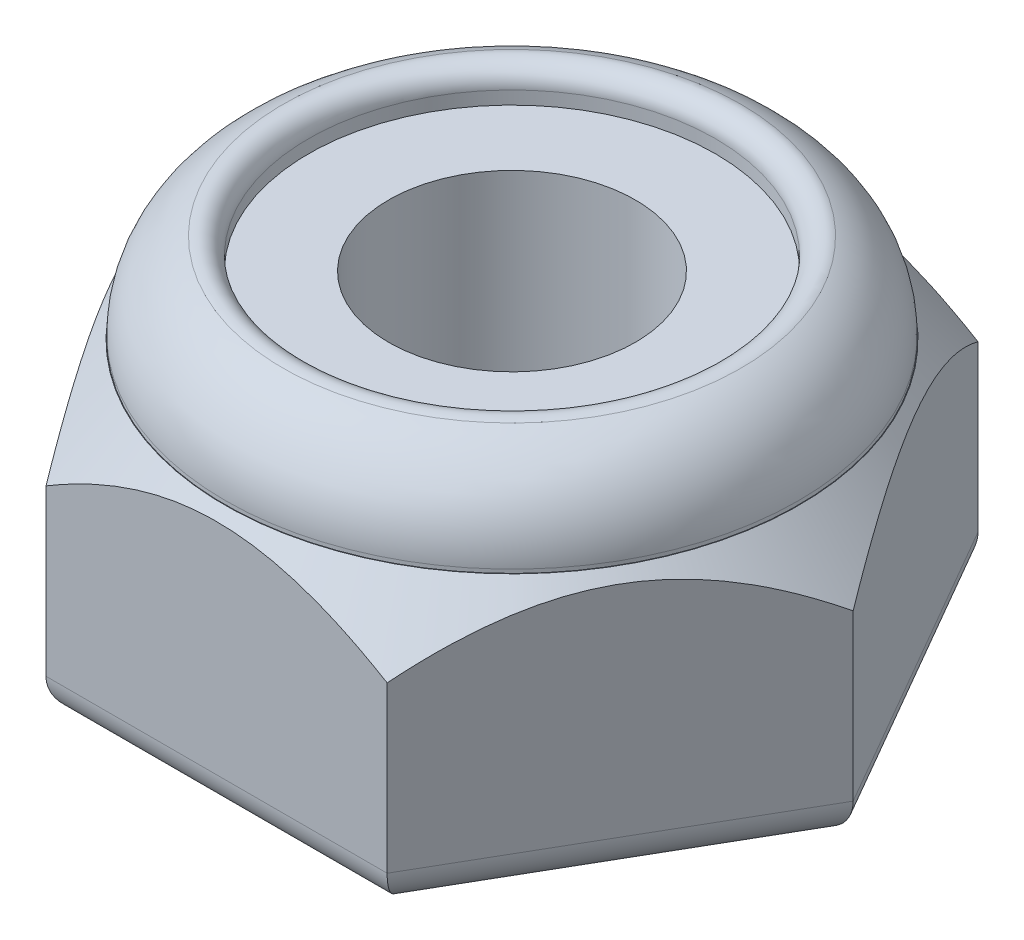
ISO-10303-21;
HEADER;
FILE_DESCRIPTION(('STEP AP214'),'2;1');
FILE_NAME('part.step','',(''),(''),'','','');
FILE_SCHEMA(('AUTOMOTIVE_DESIGN { 1 0 10303 214 1 1 1 1 }'));
ENDSEC;
DATA;
#1=APPLICATION_CONTEXT('core data for automotive mechanical design processes');
#2=APPLICATION_PROTOCOL_DEFINITION('international standard','automotive_design',2000,#1);
#3=PRODUCT_CONTEXT('',#1,'mechanical');
#4=PRODUCT('Part','Part','',(#3));
#5=PRODUCT_RELATED_PRODUCT_CATEGORY('part','',(#4));
#6=PRODUCT_DEFINITION_FORMATION('','',#4);
#7=PRODUCT_DEFINITION_CONTEXT('part definition',#1,'design');
#8=PRODUCT_DEFINITION('design','',#6,#7);
#9=PRODUCT_DEFINITION_SHAPE('','',#8);
#10=(LENGTH_UNIT() NAMED_UNIT(*) SI_UNIT(.MILLI.,.METRE.));
#11=(NAMED_UNIT(*) PLANE_ANGLE_UNIT() SI_UNIT($,.RADIAN.));
#12=(NAMED_UNIT(*) SI_UNIT($,.STERADIAN.) SOLID_ANGLE_UNIT());
#13=UNCERTAINTY_MEASURE_WITH_UNIT(LENGTH_MEASURE(1.E-05),#10,'distance_accuracy_value','');
#14=(GEOMETRIC_REPRESENTATION_CONTEXT(3) GLOBAL_UNCERTAINTY_ASSIGNED_CONTEXT((#13)) GLOBAL_UNIT_ASSIGNED_CONTEXT((#10,
#11,#12)) REPRESENTATION_CONTEXT('',''));
#15=CARTESIAN_POINT('',(0.,0.,0.));
#16=DIRECTION('',(0.,0.,1.));
#17=DIRECTION('',(1.,0.,0.));
#18=AXIS2_PLACEMENT_3D('',#15,#16,#17);
#19=CARTESIAN_POINT('',(0.,4.9784,0.));
#20=DIRECTION('',(0.,-1.,0.));
#21=DIRECTION('',(0.,0.,-1.));
#22=AXIS2_PLACEMENT_3D('',#19,#20,#21);
#23=CYLINDRICAL_SURFACE('',#22,3.937);
#24=CARTESIAN_POINT('',(0.,3.7084,0.));
#25=DIRECTION('',(0.,1.,0.));
#26=DIRECTION('',(0.,0.,1.));
#27=AXIS2_PLACEMENT_3D('',#24,#25,#26);
#28=CIRCLE('',#27,3.937);
#29=CARTESIAN_POINT('',(0.,3.7084,3.937));
#30=VERTEX_POINT('',#29);
#31=EDGE_CURVE('E275',#30,#30,#28,.T.);
#32=ORIENTED_EDGE('',*,*,#31,.F.);
#33=EDGE_LOOP('',(#32));
#34=FACE_BOUND('',#33,.T.);
#35=CARTESIAN_POINT('',(0.,3.6576,0.));
#36=DIRECTION('',(0.,-1.,0.));
#37=DIRECTION('',(0.,0.,-1.));
#38=AXIS2_PLACEMENT_3D('',#35,#36,#37);
#39=CIRCLE('',#38,3.937);
#40=CARTESIAN_POINT('',(0.,3.6576,-3.937));
#41=VERTEX_POINT('',#40);
#42=EDGE_CURVE('E19',#41,#41,#39,.F.);
#43=ORIENTED_EDGE('',*,*,#42,.T.);
#44=EDGE_LOOP('',(#43));
#45=FACE_BOUND('',#44,.T.);
#46=ADVANCED_FACE('F16',(#34,#45),#23,.T.);
#47=CARTESIAN_POINT('',(0.,3.7084,0.));
#48=DIRECTION('',(0.,1.,0.));
#49=DIRECTION('',(0.,0.,1.));
#50=AXIS2_PLACEMENT_3D('',#47,#48,#49);
#51=TOROIDAL_SURFACE('',#50,2.667,1.27);
#52=ORIENTED_EDGE('',*,*,#31,.T.);
#53=EDGE_LOOP('',(#52));
#54=FACE_BOUND('',#53,.T.);
#55=CARTESIAN_POINT('',(0.,4.88572150982644,0.));
#56=DIRECTION('',(0.,-1.,0.));
#57=DIRECTION('',(0.,0.,-1.));
#58=AXIS2_PLACEMENT_3D('',#55,#56,#57);
#59=CIRCLE('',#58,3.14325);
#60=CARTESIAN_POINT('',(0.,4.88572150982644,-3.14325));
#61=VERTEX_POINT('',#60);
#62=EDGE_CURVE('E264',#61,#61,#59,.F.);
#63=ORIENTED_EDGE('',*,*,#62,.F.);
#64=EDGE_LOOP('',(#63));
#65=FACE_BOUND('',#64,.T.);
#66=ADVANCED_FACE('F156',(#54,#65),#51,.T.);
#67=CARTESIAN_POINT('',(2.34315,3.6576,4.05845484975502));
#68=DIRECTION('',(0.,-1.,0.));
#69=DIRECTION('',(0.,0.,-1.));
#70=AXIS2_PLACEMENT_3D('',#67,#68,#69);
#71=PLANE('',#70);
#72=ORIENTED_EDGE('',*,*,#42,.F.);
#73=EDGE_LOOP('',(#72));
#74=FACE_BOUND('',#73,.T.);
#75=CARTESIAN_POINT('',(0.,3.65760000011051,0.));
#76=DIRECTION('',(0.,-1.,0.));
#77=DIRECTION('',(0.,0.,-1.));
#78=AXIS2_PLACEMENT_3D('',#75,#76,#77);
#79=CIRCLE('',#78,3.94407100938664);
#80=CARTESIAN_POINT('',(0.,3.65760000011051,-3.94407100938664));
#81=VERTEX_POINT('',#80);
#82=EDGE_CURVE('E141',#81,#81,#79,.T.);
#83=ORIENTED_EDGE('',*,*,#82,.F.);
#84=EDGE_LOOP('',(#83));
#85=FACE_BOUND('',#84,.T.);
#86=ADVANCED_FACE('F151',(#74,#85),#71,.F.);
#87=CARTESIAN_POINT('',(0.,4.65025720786115,0.));
#88=DIRECTION('',(0.,-1.,0.));
#89=DIRECTION('',(0.,0.,-1.));
#90=AXIS2_PLACEMENT_3D('',#87,#88,#89);
#91=TOROIDAL_SURFACE('',#90,3.048,0.254);
#92=CARTESIAN_POINT('',(0.,4.65025720786115,0.));
#93=DIRECTION('',(0.,1.,0.));
#94=DIRECTION('',(0.,0.,1.));
#95=AXIS2_PLACEMENT_3D('',#92,#93,#94);
#96=CIRCLE('',#95,2.794);
#97=CARTESIAN_POINT('',(0.,4.65025720786115,2.794));
#98=VERTEX_POINT('',#97);
#99=EDGE_CURVE('E120',#98,#98,#96,.F.);
#100=ORIENTED_EDGE('',*,*,#99,.T.);
#101=EDGE_LOOP('',(#100));
#102=FACE_BOUND('',#101,.T.);
#103=ORIENTED_EDGE('',*,*,#62,.T.);
#104=EDGE_LOOP('',(#103));
#105=FACE_BOUND('',#104,.T.);
#106=ADVANCED_FACE('F147',(#102,#105),#91,.T.);
#107=CARTESIAN_POINT('',(0.,2.76773860969115,0.));
#108=DIRECTION('',(0.,-1.,0.));
#109=DIRECTION('',(0.,0.,-1.));
#110=AXIS2_PLACEMENT_3D('',#107,#108,#109);
#111=CONICAL_SURFACE('',#110,4.69075337389313,0.698131700802158);
#112=CARTESIAN_POINT('',(-4.68630000001476,2.77304593398821,-5.33338044389321E-11));
#113=CARTESIAN_POINT('',(-4.65177717141793,2.81418235889091,0.0597952931149053));
#114=CARTESIAN_POINT('',(-4.61695780288956,2.85432113110728,0.120104208500933));
#115=CARTESIAN_POINT('',(-4.54666264441453,2.93230661020916,0.241858994511412));
#116=CARTESIAN_POINT('',(-4.51118655194523,2.97015222462005,0.303305389120424));
#117=CARTESIAN_POINT('',(-4.40329561885259,3.08018701500149,0.490177966909937));
#118=CARTESIAN_POINT('',(-4.32983334004397,3.14837015576205,0.617418366247689));
#119=CARTESIAN_POINT('',(-4.1797796499728,3.27092778609509,0.877318981315214));
#120=CARTESIAN_POINT('',(-4.10317943932402,3.32525984886677,1.00999443802899));
#121=CARTESIAN_POINT('',(-3.94747591651277,3.41577217646148,1.27968085045525));
#122=CARTESIAN_POINT('',(-3.86837998243724,3.45200143013375,1.4166790269463));
#123=CARTESIAN_POINT('',(-3.73746585196202,3.49372811243502,1.64342895235813));
#124=CARTESIAN_POINT('',(-3.68614686019516,3.50560413715319,1.73231605349153));
#125=CARTESIAN_POINT('',(-3.58316406708587,3.52008140702852,1.91068748346216));
#126=CARTESIAN_POINT('',(-3.53150020834088,3.5226810675312,2.00017191172355));
#127=CARTESIAN_POINT('',(-3.42855034551142,3.51847006524789,2.17848630477643));
#128=CARTESIAN_POINT('',(-3.3772638088531,3.51171021118306,2.26731719201287));
#129=CARTESIAN_POINT('',(-3.27519197708947,3.48921023555424,2.4441107906491));
#130=CARTESIAN_POINT('',(-3.22440670715057,3.4734696654174,2.53207345845939));
#131=CARTESIAN_POINT('',(-3.10963060134479,3.42817062222156,2.73087150520989));
#132=CARTESIAN_POINT('',(-3.04589899577138,3.39598542076133,2.84125788411099));
#133=CARTESIAN_POINT('',(-2.92018166739655,3.32004827846255,3.05900668424801));
#134=CARTESIAN_POINT('',(-2.85819691962206,3.27629001415058,3.16636741668776));
#135=CARTESIAN_POINT('',(-2.735889068299,3.17910361386979,3.37821082934389));
#136=CARTESIAN_POINT('',(-2.67557364738244,3.12563730731956,3.48268020285126));
#137=CARTESIAN_POINT('',(-2.55683004320588,3.01104764609313,3.68835015835892));
#138=CARTESIAN_POINT('',(-2.49840123089761,2.94992687749399,3.78955182990274));
#139=CARTESIAN_POINT('',(-2.42439626092569,2.86741854625153,3.91773219790672));
#140=CARTESIAN_POINT('',(-2.40802320106583,2.84883596648691,3.94609116945937));
#141=CARTESIAN_POINT('',(-2.3754621576302,2.81125673907332,4.00248855103733));
#142=CARTESIAN_POINT('',(-2.35927376441604,2.79226151161516,4.03052767057717));
#143=CARTESIAN_POINT('',(-2.3431499999717,2.77304593399368,4.05845484980404));
#144=B_SPLINE_CURVE_WITH_KNOTS('',3,(#112,#113,#114,#115,#116,#117,#118,#119,#120,#121,#122,
#123,#124,#125,#126,#127,#128,#129,#130,#131,#132,#133,#134,#135,#136,#137,#138,#139,#140,#141,
#142,#143),.UNSPECIFIED.,.F.,.F.,(4,2,2,2,2,2,2,2,2,2,2,2,2,2,2,4),(0.,0.241096809088565,
0.48230758945251,0.967637153847366,1.45443592242802,1.93991010956963,2.24950193433618,
2.55914664324831,2.86711700071403,3.17510274216898,3.56882084711336,3.96275452403261,
4.35827201930639,4.75365624679115,4.86660838982692,4.97921936905084),.UNSPECIFIED.);
#145=CARTESIAN_POINT('',(-4.68630000002839,2.77304593399358,0.));
#146=VERTEX_POINT('',#145);
#147=CARTESIAN_POINT('',(-2.34315000001419,2.77304593399358,4.05845484977959));
#148=VERTEX_POINT('',#147);
#149=EDGE_CURVE('E106',#146,#148,#144,.T.);
#150=ORIENTED_EDGE('',*,*,#149,.T.);
#151=CARTESIAN_POINT('',(-2.34315000005357,2.77304593398822,4.05845484974113));
#152=CARTESIAN_POINT('',(-2.27415972170409,2.81414935271336,4.05845484974989));
#153=CARTESIAN_POINT('',(-2.20457738522044,2.85425669884705,4.05845484975361));
#154=CARTESIAN_POINT('',(-2.06410193528095,2.93218331968194,4.05845484975642));
#155=CARTESIAN_POINT('',(-1.99320821641151,2.9700015013142,4.05845484975551));
#156=CARTESIAN_POINT('',(-1.77754688772429,3.07999086386455,4.05845484975401));
#157=CARTESIAN_POINT('',(-1.63068545869954,3.1481589403704,4.05845484975469));
#158=CARTESIAN_POINT('',(-1.33052752457963,3.27077676919262,4.05845484975534));
#159=CARTESIAN_POINT('',(-1.17720631609342,3.32516696804196,4.0584548497553));
#160=CARTESIAN_POINT('',(-0.86561350380778,3.41574608766059,4.05845484975473));
#161=CARTESIAN_POINT('',(-0.707359229311903,3.45199244874899,4.0584548497542));
#162=CARTESIAN_POINT('',(-0.456822143345071,3.49192146546895,4.05845484975548));
#163=CARTESIAN_POINT('',(-0.365672921156202,3.50290887295604,4.05845484975637));
#164=CARTESIAN_POINT('',(-0.183016322004482,3.51758027913678,4.05845484975366));
#165=CARTESIAN_POINT('',(-0.0915105175250816,3.52128341037061,4.05845484975007));
#166=CARTESIAN_POINT('',(0.104649468641441,3.52128177491765,4.0584548497495));
#167=CARTESIAN_POINT('',(0.209305100872023,3.51643705333648,4.05845484975354));
#168=CARTESIAN_POINT('',(0.41778718190987,3.49730239560235,4.05845484975649));
#169=CARTESIAN_POINT('',(0.521613181352877,3.48300765111694,4.05845484975541));
#170=CARTESIAN_POINT('',(0.728332544913561,3.44553375886282,4.05845484975462));
#171=CARTESIAN_POINT('',(0.831215331558566,3.42229697724238,4.05845484975491));
#172=CARTESIAN_POINT('',(1.03487580391125,3.36791830054733,4.05845484975512));
#173=CARTESIAN_POINT('',(1.13565289468809,3.33677420321768,4.05845484975504));
#174=CARTESIAN_POINT('',(1.33273383822163,3.26838741918099,4.05845484975499));
#175=CARTESIAN_POINT('',(1.42908716226035,3.23128582684656,4.05845484975501));
#176=CARTESIAN_POINT('',(1.61947291708309,3.15151071591982,4.05845484975502));
#177=CARTESIAN_POINT('',(1.71350470709807,3.10883567899407,4.05845484975502));
#178=CARTESIAN_POINT('',(1.89803195382395,3.01941532331662,4.05845484975501));
#179=CARTESIAN_POINT('',(1.98855798046432,2.97273255726059,4.05845484975502));
#180=CARTESIAN_POINT('',(2.16742834958163,2.87556944084479,4.05845484975502));
#181=CARTESIAN_POINT('',(2.25577492892455,2.82509321932285,4.05845484975502));
#182=CARTESIAN_POINT('',(2.34315000005566,2.77304593399424,4.05845484975502));
#183=B_SPLINE_CURVE_WITH_KNOTS('',3,(#151,#152,#153,#154,#155,#156,#157,#158,#159,#160,#161,
#162,#163,#164,#165,#166,#167,#168,#169,#170,#171,#172,#173,#174,#175,#176,#177,#178,#179,#180,
#181,#182),.UNSPECIFIED.,.F.,.F.,(4,2,2,2,2,2,2,2,2,2,2,2,2,2,2,4),(0.,0.24090330355952,
0.481920744736242,0.967059466968447,1.4542606837498,1.93990959177134,2.21507934695766,
2.4895253838939,2.80337599596431,3.11738642360393,3.43345557972405,3.74961286055439,
4.0591611810716,4.36879400620232,4.67425708545866,4.97939238068026),.UNSPECIFIED.);
#184=CARTESIAN_POINT('',(2.34315000001419,2.77304593399358,4.05845484977959));
#185=VERTEX_POINT('',#184);
#186=EDGE_CURVE('E98',#148,#185,#183,.T.);
#187=ORIENTED_EDGE('',*,*,#186,.T.);
#188=CARTESIAN_POINT('',(2.3431499999612,2.77304593398822,4.05845484979446));
#189=CARTESIAN_POINT('',(2.37767282857321,2.81418235889091,3.99865955663499));
#190=CARTESIAN_POINT('',(2.41249219710801,2.85432113110729,3.93835064125267));
#191=CARTESIAN_POINT('',(2.48278735558791,2.93230661020917,3.816595855245));
#192=CARTESIAN_POINT('',(2.51826344805563,2.97015222462005,3.75514946063508));
#193=CARTESIAN_POINT('',(2.62615438114571,3.0801870150015,3.56827688284408));
#194=CARTESIAN_POINT('',(2.69961665995557,3.14837015576206,3.44103648350706));
#195=CARTESIAN_POINT('',(2.84967035002766,3.2709277860951,3.18113586844006));
#196=CARTESIAN_POINT('',(2.9262705606761,3.32525984886677,3.04846041172609));
#197=CARTESIAN_POINT('',(3.08197408348711,3.41577217646148,2.77877399929969));
#198=CARTESIAN_POINT('',(3.16107001756274,3.45200143013376,2.64177582280869));
#199=CARTESIAN_POINT('',(3.291984148038,3.49372811243503,2.41502589739689));
#200=CARTESIAN_POINT('',(3.34330313980485,3.50560413715319,2.32613879626348));
#201=CARTESIAN_POINT('',(3.44628593291413,3.52008140702853,2.14776736629285));
#202=CARTESIAN_POINT('',(3.49794979165912,3.52268106753121,2.05828293803146));
#203=CARTESIAN_POINT('',(3.60089965448859,3.51847006524789,1.87996854497858));
#204=CARTESIAN_POINT('',(3.6521861911469,3.51171021118306,1.79113765774214));
#205=CARTESIAN_POINT('',(3.75425802291053,3.48921023555425,1.61434405910591));
#206=CARTESIAN_POINT('',(3.80504329284943,3.47346966541741,1.52638139129562));
#207=CARTESIAN_POINT('',(3.91981939865521,3.42817062222156,1.32758334454512));
#208=CARTESIAN_POINT('',(3.98355100422862,3.39598542076133,1.21719696564402));
#209=CARTESIAN_POINT('',(4.10926833260345,3.32004827846255,0.999448165506998));
#210=CARTESIAN_POINT('',(4.17125308037794,3.27629001415058,0.892087433067249));
#211=CARTESIAN_POINT('',(4.293560931701,3.17910361386979,0.680244020411123));
#212=CARTESIAN_POINT('',(4.35387635261756,3.12563730731956,0.575774646903748));
#213=CARTESIAN_POINT('',(4.47261995679412,3.01104764609313,0.370104691396085));
#214=CARTESIAN_POINT('',(4.53104876910239,2.94992687749399,0.268903019852267));
#215=CARTESIAN_POINT('',(4.60505373907431,2.86741854625153,0.140722651848287));
#216=CARTESIAN_POINT('',(4.62142679893417,2.84883596648691,0.112363680295637));
#217=CARTESIAN_POINT('',(4.6539878423698,2.81125673907332,0.0559662987176779));
#218=CARTESIAN_POINT('',(4.67017623558396,2.79226151161516,0.0279271791778418));
#219=CARTESIAN_POINT('',(4.6863000000283,2.77304593399368,-4.90270010654762E-11));
#220=B_SPLINE_CURVE_WITH_KNOTS('',3,(#188,#189,#190,#191,#192,#193,#194,#195,#196,#197,#198,
#199,#200,#201,#202,#203,#204,#205,#206,#207,#208,#209,#210,#211,#212,#213,#214,#215,#216,#217,
#218,#219),.UNSPECIFIED.,.F.,.F.,(4,2,2,2,2,2,2,2,2,2,2,2,2,2,2,4),(0.,0.241096809088565,
0.48230758945251,0.967637153847364,1.45443592242802,1.93991010956962,2.24950193433617,
2.5591466432483,2.86711700071402,3.17510274216897,3.56882084711336,3.9627545240326,
4.35827201930639,4.75365624679114,4.86660838982692,4.97921936905084),.UNSPECIFIED.);
#221=CARTESIAN_POINT('',(4.68630000001419,2.7730459340105,-2.45819040202403E-11));
#222=VERTEX_POINT('',#221);
#223=EDGE_CURVE('E103',#185,#222,#220,.T.);
#224=ORIENTED_EDGE('',*,*,#223,.T.);
#225=CARTESIAN_POINT('',(4.68630000001476,2.77304593398822,5.33267015141622E-11));
#226=CARTESIAN_POINT('',(4.65177717141792,2.81418235889091,-0.0597952931149122));
#227=CARTESIAN_POINT('',(4.61695780288956,2.85432113110729,-0.12010420850094));
#228=CARTESIAN_POINT('',(4.54666264441452,2.93230661020917,-0.241858994511418));
#229=CARTESIAN_POINT('',(4.51118655194522,2.97015222462005,-0.303305389120429));
#230=CARTESIAN_POINT('',(4.40329561885258,3.0801870150015,-0.490177966909942));
#231=CARTESIAN_POINT('',(4.32983334004397,3.14837015576206,-0.617418366247693));
#232=CARTESIAN_POINT('',(4.1797796499728,3.27092778609509,-0.877318981315217));
#233=CARTESIAN_POINT('',(4.10317943932402,3.32525984886677,-1.00999443802899));
#234=CARTESIAN_POINT('',(3.94747591651277,3.41577217646148,-1.27968085045525));
#235=CARTESIAN_POINT('',(3.86837998243724,3.45200143013375,-1.4166790269463));
#236=CARTESIAN_POINT('',(3.73746585196202,3.49372811243502,-1.64342895235813));
#237=CARTESIAN_POINT('',(3.68614686019516,3.50560413715319,-1.73231605349153));
#238=CARTESIAN_POINT('',(3.58316406708587,3.52008140702852,-1.91068748346216));
#239=CARTESIAN_POINT('',(3.53150020834088,3.5226810675312,-2.00017191172355));
#240=CARTESIAN_POINT('',(3.42855034551142,3.51847006524789,-2.17848630477643));
#241=CARTESIAN_POINT('',(3.3772638088531,3.51171021118306,-2.26731719201287));
#242=CARTESIAN_POINT('',(3.27519197708947,3.48921023555424,-2.4441107906491));
#243=CARTESIAN_POINT('',(3.22440670715057,3.4734696654174,-2.53207345845939));
#244=CARTESIAN_POINT('',(3.10963060134479,3.42817062222156,-2.73087150520989));
#245=CARTESIAN_POINT('',(3.04589899577138,3.39598542076133,-2.84125788411098));
#246=CARTESIAN_POINT('',(2.92018166739655,3.32004827846255,-3.05900668424801));
#247=CARTESIAN_POINT('',(2.85819691962206,3.27629001415058,-3.16636741668776));
#248=CARTESIAN_POINT('',(2.735889068299,3.17910361386979,-3.37821082934388));
#249=CARTESIAN_POINT('',(2.67557364738245,3.12563730731956,-3.48268020285126));
#250=CARTESIAN_POINT('',(2.55683004320588,3.01104764609313,-3.68835015835892));
#251=CARTESIAN_POINT('',(2.49840123089761,2.94992687749399,-3.78955182990274));
#252=CARTESIAN_POINT('',(2.42439626092569,2.86741854625153,-3.91773219790672));
#253=CARTESIAN_POINT('',(2.40802320106583,2.84883596648691,-3.94609116945937));
#254=CARTESIAN_POINT('',(2.3754621576302,2.81125673907332,-4.00248855103733));
#255=CARTESIAN_POINT('',(2.35927376441604,2.79226151161516,-4.03052767057717));
#256=CARTESIAN_POINT('',(2.3431499999717,2.77304593399368,-4.05845484980404));
#257=B_SPLINE_CURVE_WITH_KNOTS('',3,(#225,#226,#227,#228,#229,#230,#231,#232,#233,#234,#235,
#236,#237,#238,#239,#240,#241,#242,#243,#244,#245,#246,#247,#248,#249,#250,#251,#252,#253,#254,
#255,#256),.UNSPECIFIED.,.F.,.F.,(4,2,2,2,2,2,2,2,2,2,2,2,2,2,2,4),(0.,0.241096809088563,
0.482307589452507,0.967637153847359,1.45443592242801,1.93991010956962,2.24950193433616,
2.55914664324829,2.86711700071401,3.17510274216897,3.56882084711335,3.96275452403259,
4.35827201930638,4.75365624679114,4.86660838982692,4.97921936905084),.UNSPECIFIED.);
#258=CARTESIAN_POINT('',(2.34315000001419,2.77304593399358,-4.0584548497796));
#259=VERTEX_POINT('',#258);
#260=EDGE_CURVE('E216',#222,#259,#257,.T.);
#261=ORIENTED_EDGE('',*,*,#260,.T.);
#262=CARTESIAN_POINT('',(2.34315000005357,2.77304593398821,-4.05845484974114));
#263=CARTESIAN_POINT('',(2.27415972170409,2.81414935271335,-4.05845484974989));
#264=CARTESIAN_POINT('',(2.20457738522045,2.85425669884704,-4.05845484975361));
#265=CARTESIAN_POINT('',(2.06410193528096,2.93218331968193,-4.05845484975643));
#266=CARTESIAN_POINT('',(1.99320821641151,2.97000150131419,-4.05845484975552));
#267=CARTESIAN_POINT('',(1.77754688772429,3.07999086386454,-4.05845484975402));
#268=CARTESIAN_POINT('',(1.63068545869954,3.1481589403704,-4.0584548497547));
#269=CARTESIAN_POINT('',(1.33052752457963,3.27077676919261,-4.05845484975534));
#270=CARTESIAN_POINT('',(1.17720631609342,3.32516696804195,-4.0584548497553));
#271=CARTESIAN_POINT('',(0.865613503807778,3.41574608766058,-4.05845484975474));
#272=CARTESIAN_POINT('',(0.707359229311901,3.45199244874898,-4.0584548497542));
#273=CARTESIAN_POINT('',(0.456822143345069,3.49192146546895,-4.05845484975548));
#274=CARTESIAN_POINT('',(0.365672921156201,3.50290887295604,-4.05845484975637));
#275=CARTESIAN_POINT('',(0.183016322004481,3.51758027913677,-4.05845484975367));
#276=CARTESIAN_POINT('',(0.0915105175250814,3.5212834103706,-4.05845484975008));
#277=CARTESIAN_POINT('',(-0.104649468641441,3.52128177491764,-4.0584548497495));
#278=CARTESIAN_POINT('',(-0.209305100872023,3.51643705333648,-4.05845484975354));
#279=CARTESIAN_POINT('',(-0.41778718190987,3.49730239560234,-4.0584548497565));
#280=CARTESIAN_POINT('',(-0.521613181352877,3.48300765111693,-4.05845484975542));
#281=CARTESIAN_POINT('',(-0.728332544913562,3.44553375886281,-4.05845484975462));
#282=CARTESIAN_POINT('',(-0.831215331558566,3.42229697724237,-4.05845484975491));
#283=CARTESIAN_POINT('',(-1.03487580391125,3.36791830054732,-4.05845484975513));
#284=CARTESIAN_POINT('',(-1.13565289468809,3.33677420321767,-4.05845484975505));
#285=CARTESIAN_POINT('',(-1.33273383822163,3.26838741918098,-4.05845484975499));
#286=CARTESIAN_POINT('',(-1.42908716226035,3.23128582684655,-4.05845484975501));
#287=CARTESIAN_POINT('',(-1.61947291708309,3.15151071591982,-4.05845484975503));
#288=CARTESIAN_POINT('',(-1.71350470709807,3.10883567899406,-4.05845484975502));
#289=CARTESIAN_POINT('',(-1.89803195382395,3.01941532331662,-4.05845484975502));
#290=CARTESIAN_POINT('',(-1.98855798046431,2.97273255726059,-4.05845484975502));
#291=CARTESIAN_POINT('',(-2.16742834958162,2.87556944084479,-4.05845484975502));
#292=CARTESIAN_POINT('',(-2.25577492892455,2.82509321932284,-4.05845484975502));
#293=CARTESIAN_POINT('',(-2.34315000005566,2.77304593399424,-4.05845484975502));
#294=B_SPLINE_CURVE_WITH_KNOTS('',3,(#262,#263,#264,#265,#266,#267,#268,#269,#270,#271,#272,
#273,#274,#275,#276,#277,#278,#279,#280,#281,#282,#283,#284,#285,#286,#287,#288,#289,#290,#291,
#292,#293),.UNSPECIFIED.,.F.,.F.,(4,2,2,2,2,2,2,2,2,2,2,2,2,2,2,4),(0.,0.24090330355952,
0.481920744736243,0.96705946696845,1.4542606837498,1.93990959177135,2.21507934695766,
2.48952538389391,2.80337599596432,3.11738642360394,3.43345557972405,3.74961286055439,
4.0591611810716,4.36879400620232,4.67425708545866,4.97939238068026),.UNSPECIFIED.);
#295=CARTESIAN_POINT('',(-2.34315000001419,2.77304593399358,-4.0584548497796));
#296=VERTEX_POINT('',#295);
#297=EDGE_CURVE('E227',#259,#296,#294,.T.);
#298=ORIENTED_EDGE('',*,*,#297,.T.);
#299=CARTESIAN_POINT('',(-2.3431499999612,2.77304593398821,-4.05845484979447));
#300=CARTESIAN_POINT('',(-2.37767282857321,2.81418235889091,-3.99865955663499));
#301=CARTESIAN_POINT('',(-2.41249219710802,2.85432113110728,-3.93835064125268));
#302=CARTESIAN_POINT('',(-2.48278735558791,2.93230661020916,-3.81659585524501));
#303=CARTESIAN_POINT('',(-2.51826344805563,2.97015222462005,-3.75514946063508));
#304=CARTESIAN_POINT('',(-2.62615438114571,3.08018701500149,-3.56827688284409));
#305=CARTESIAN_POINT('',(-2.69961665995557,3.14837015576205,-3.44103648350706));
#306=CARTESIAN_POINT('',(-2.84967035002766,3.27092778609509,-3.18113586844007));
#307=CARTESIAN_POINT('',(-2.9262705606761,3.32525984886676,-3.0484604117261));
#308=CARTESIAN_POINT('',(-3.08197408348711,3.41577217646147,-2.7787739992997));
#309=CARTESIAN_POINT('',(-3.16107001756274,3.45200143013375,-2.6417758228087));
#310=CARTESIAN_POINT('',(-3.291984148038,3.49372811243502,-2.4150258973969));
#311=CARTESIAN_POINT('',(-3.34330313980485,3.50560413715318,-2.32613879626349));
#312=CARTESIAN_POINT('',(-3.44628593291413,3.52008140702852,-2.14776736629286));
#313=CARTESIAN_POINT('',(-3.49794979165912,3.5226810675312,-2.05828293803147));
#314=CARTESIAN_POINT('',(-3.60089965448859,3.51847006524788,-1.87996854497859));
#315=CARTESIAN_POINT('',(-3.6521861911469,3.51171021118305,-1.79113765774215));
#316=CARTESIAN_POINT('',(-3.75425802291053,3.48921023555424,-1.61434405910592));
#317=CARTESIAN_POINT('',(-3.80504329284944,3.4734696654174,-1.52638139129563));
#318=CARTESIAN_POINT('',(-3.91981939865521,3.42817062222155,-1.32758334454513));
#319=CARTESIAN_POINT('',(-3.98355100422863,3.39598542076132,-1.21719696564403));
#320=CARTESIAN_POINT('',(-4.10926833260346,3.32004827846254,-0.999448165507007));
#321=CARTESIAN_POINT('',(-4.17125308037794,3.27629001415057,-0.892087433067259));
#322=CARTESIAN_POINT('',(-4.29356093170101,3.17910361386978,-0.680244020411133));
#323=CARTESIAN_POINT('',(-4.35387635261756,3.12563730731955,-0.575774646903757));
#324=CARTESIAN_POINT('',(-4.47261995679413,3.01104764609312,-0.370104691396094));
#325=CARTESIAN_POINT('',(-4.53104876910239,2.94992687749399,-0.268903019852276));
#326=CARTESIAN_POINT('',(-4.60505373907432,2.86741854625152,-0.140722651848295));
#327=CARTESIAN_POINT('',(-4.62142679893418,2.84883596648691,-0.112363680295645));
#328=CARTESIAN_POINT('',(-4.6539878423698,2.81125673907331,-0.0559662987176854));
#329=CARTESIAN_POINT('',(-4.67017623558397,2.79226151161515,-0.0279271791778493));
#330=CARTESIAN_POINT('',(-4.68630000002831,2.77304593399367,4.90195592876359E-11));
#331=B_SPLINE_CURVE_WITH_KNOTS('',3,(#299,#300,#301,#302,#303,#304,#305,#306,#307,#308,#309,
#310,#311,#312,#313,#314,#315,#316,#317,#318,#319,#320,#321,#322,#323,#324,#325,#326,#327,#328,
#329,#330),.UNSPECIFIED.,.F.,.F.,(4,2,2,2,2,2,2,2,2,2,2,2,2,2,2,4),(0.,0.241096809088565,
0.482307589452509,0.967637153847361,1.45443592242802,1.93991010956962,2.24950193433617,
2.5591466432483,2.86711700071402,3.17510274216897,3.56882084711335,3.9627545240326,
4.35827201930639,4.75365624679114,4.86660838982692,4.97921936905084),.UNSPECIFIED.);
#332=EDGE_CURVE('E234',#296,#146,#331,.T.);
#333=ORIENTED_EDGE('',*,*,#332,.T.);
#334=EDGE_LOOP('',(#150,#187,#224,#261,#298,#333));
#335=FACE_BOUND('',#334,.T.);
#336=ORIENTED_EDGE('',*,*,#82,.T.);
#337=EDGE_LOOP('',(#336));
#338=FACE_BOUND('',#337,.T.);
#339=ADVANCED_FACE('F100',(#335,#338),#111,.T.);
#340=CARTESIAN_POINT('',(0.,4.4704,0.));
#341=DIRECTION('',(0.,1.,0.));
#342=DIRECTION('',(0.,0.,1.));
#343=AXIS2_PLACEMENT_3D('',#340,#341,#342);
#344=CYLINDRICAL_SURFACE('',#343,2.794);
#345=ORIENTED_EDGE('',*,*,#99,.F.);
#346=EDGE_LOOP('',(#345));
#347=FACE_BOUND('',#346,.T.);
#348=CARTESIAN_POINT('',(0.,4.4704,0.));
#349=DIRECTION('',(0.,1.,0.));
#350=DIRECTION('',(0.,0.,1.));
#351=AXIS2_PLACEMENT_3D('',#348,#349,#350);
#352=CIRCLE('',#351,2.794);
#353=CARTESIAN_POINT('',(0.,4.4704,2.794));
#354=VERTEX_POINT('',#353);
#355=EDGE_CURVE('E225',#354,#354,#352,.T.);
#356=ORIENTED_EDGE('',*,*,#355,.F.);
#357=EDGE_LOOP('',(#356));
#358=FACE_BOUND('',#357,.T.);
#359=ADVANCED_FACE('F454',(#347,#358),#344,.F.);
#360=CARTESIAN_POINT('',(2.34315,3.6576,4.05845484975502));
#361=DIRECTION('',(-0.866025403784439,0.,-0.499999999999999));
#362=DIRECTION('',(-0.499999999999999,0.,0.866025403784439));
#363=AXIS2_PLACEMENT_3D('',#360,#361,#362);
#364=PLANE('',#363);
#365=DIRECTION('',(-0.499999999999999,0.,0.866025403784439));
#366=VECTOR('',#365,1.);
#367=CARTESIAN_POINT('',(2.34315,0.508,4.05845484975502));
#368=LINE('',#367,#366);
#369=CARTESIAN_POINT('',(4.6863,0.508,0.));
#370=VERTEX_POINT('',#369);
#371=CARTESIAN_POINT('',(2.34315000000001,0.508,4.05845484975502));
#372=VERTEX_POINT('',#371);
#373=EDGE_CURVE('E305',#370,#372,#368,.T.);
#374=ORIENTED_EDGE('',*,*,#373,.F.);
#375=DIRECTION('',(0.,1.,0.));
#376=VECTOR('',#375,1.);
#377=CARTESIAN_POINT('',(4.6863,3.6576,0.));
#378=LINE('',#377,#376);
#379=EDGE_CURVE('E117',#370,#222,#378,.T.);
#380=ORIENTED_EDGE('',*,*,#379,.T.);
#381=ORIENTED_EDGE('',*,*,#223,.F.);
#382=DIRECTION('',(0.,1.,0.));
#383=VECTOR('',#382,1.);
#384=CARTESIAN_POINT('',(2.34315000000001,3.6576,4.05845484975502));
#385=LINE('',#384,#383);
#386=EDGE_CURVE('E110',#185,#372,#385,.F.);
#387=ORIENTED_EDGE('',*,*,#386,.T.);
#388=EDGE_LOOP('',(#374,#380,#381,#387));
#389=FACE_BOUND('',#388,.T.);
#390=ADVANCED_FACE('F114',(#389),#364,.F.);
#391=CARTESIAN_POINT('',(-2.34315,3.6576,4.05845484975501));
#392=DIRECTION('',(0.,0.,-1.));
#393=DIRECTION('',(-1.,0.,0.));
#394=AXIS2_PLACEMENT_3D('',#391,#392,#393);
#395=PLANE('',#394);
#396=DIRECTION('',(-1.,0.,0.));
#397=VECTOR('',#396,1.);
#398=CARTESIAN_POINT('',(-2.34315,0.508,4.05845484975501));
#399=LINE('',#398,#397);
#400=CARTESIAN_POINT('',(-2.34315,0.508,4.05845484975501));
#401=VERTEX_POINT('',#400);
#402=EDGE_CURVE('E125',#372,#401,#399,.T.);
#403=ORIENTED_EDGE('',*,*,#402,.F.);
#404=ORIENTED_EDGE('',*,*,#386,.F.);
#405=ORIENTED_EDGE('',*,*,#186,.F.);
#406=DIRECTION('',(0.,1.,0.));
#407=VECTOR('',#406,1.);
#408=CARTESIAN_POINT('',(-2.34315,3.6576,4.05845484975501));
#409=LINE('',#408,#407);
#410=EDGE_CURVE('E133',#148,#401,#409,.F.);
#411=ORIENTED_EDGE('',*,*,#410,.T.);
#412=EDGE_LOOP('',(#403,#404,#405,#411));
#413=FACE_BOUND('',#412,.T.);
#414=ADVANCED_FACE('F123',(#413),#395,.F.);
#415=CARTESIAN_POINT('',(-4.6863,3.6576,0.));
#416=DIRECTION('',(0.866025403784439,0.,-0.5));
#417=DIRECTION('',(-0.5,0.,-0.866025403784439));
#418=AXIS2_PLACEMENT_3D('',#415,#416,#417);
#419=PLANE('',#418);
#420=DIRECTION('',(-0.5,0.,-0.866025403784439));
#421=VECTOR('',#420,1.);
#422=CARTESIAN_POINT('',(-4.6863,0.508,0.));
#423=LINE('',#422,#421);
#424=CARTESIAN_POINT('',(-4.68630000000001,0.508,0.));
#425=VERTEX_POINT('',#424);
#426=EDGE_CURVE('E300',#401,#425,#423,.T.);
#427=ORIENTED_EDGE('',*,*,#426,.F.);
#428=ORIENTED_EDGE('',*,*,#410,.F.);
#429=ORIENTED_EDGE('',*,*,#149,.F.);
#430=DIRECTION('',(0.,1.,0.));
#431=VECTOR('',#430,1.);
#432=CARTESIAN_POINT('',(-4.68630000000001,3.6576,0.));
#433=LINE('',#432,#431);
#434=EDGE_CURVE('E233',#146,#425,#433,.F.);
#435=ORIENTED_EDGE('',*,*,#434,.T.);
#436=EDGE_LOOP('',(#427,#428,#429,#435));
#437=FACE_BOUND('',#436,.T.);
#438=ADVANCED_FACE('F246',(#437),#419,.F.);
#439=CARTESIAN_POINT('',(-2.34315,3.6576,-4.05845484975502));
#440=DIRECTION('',(0.866025403784438,0.,0.5));
#441=DIRECTION('',(0.5,0.,-0.866025403784438));
#442=AXIS2_PLACEMENT_3D('',#439,#440,#441);
#443=PLANE('',#442);
#444=DIRECTION('',(0.5,0.,-0.866025403784438));
#445=VECTOR('',#444,1.);
#446=CARTESIAN_POINT('',(-2.34315,0.508,-4.05845484975502));
#447=LINE('',#446,#445);
#448=CARTESIAN_POINT('',(-2.34315,0.508,-4.05845484975502));
#449=VERTEX_POINT('',#448);
#450=EDGE_CURVE('E295',#425,#449,#447,.T.);
#451=ORIENTED_EDGE('',*,*,#450,.F.);
#452=ORIENTED_EDGE('',*,*,#434,.F.);
#453=ORIENTED_EDGE('',*,*,#332,.F.);
#454=DIRECTION('',(0.,1.,0.));
#455=VECTOR('',#454,1.);
#456=CARTESIAN_POINT('',(-2.34315,3.6576,-4.05845484975502));
#457=LINE('',#456,#455);
#458=EDGE_CURVE('E224',#296,#449,#457,.F.);
#459=ORIENTED_EDGE('',*,*,#458,.T.);
#460=EDGE_LOOP('',(#451,#452,#453,#459));
#461=FACE_BOUND('',#460,.T.);
#462=ADVANCED_FACE('F243',(#461),#443,.F.);
#463=CARTESIAN_POINT('',(2.34315,3.6576,-4.05845484975502));
#464=DIRECTION('',(0.,0.,1.));
#465=DIRECTION('',(1.,0.,0.));
#466=AXIS2_PLACEMENT_3D('',#463,#464,#465);
#467=PLANE('',#466);
#468=DIRECTION('',(1.,0.,0.));
#469=VECTOR('',#468,1.);
#470=CARTESIAN_POINT('',(2.34315,0.508,-4.05845484975502));
#471=LINE('',#470,#469);
#472=CARTESIAN_POINT('',(2.34315,0.508,-4.05845484975502));
#473=VERTEX_POINT('',#472);
#474=EDGE_CURVE('E290',#449,#473,#471,.T.);
#475=ORIENTED_EDGE('',*,*,#474,.F.);
#476=ORIENTED_EDGE('',*,*,#458,.F.);
#477=ORIENTED_EDGE('',*,*,#297,.F.);
#478=DIRECTION('',(0.,1.,0.));
#479=VECTOR('',#478,1.);
#480=CARTESIAN_POINT('',(2.34315,3.6576,-4.05845484975501));
#481=LINE('',#480,#479);
#482=EDGE_CURVE('E223',#259,#473,#481,.F.);
#483=ORIENTED_EDGE('',*,*,#482,.T.);
#484=EDGE_LOOP('',(#475,#476,#477,#483));
#485=FACE_BOUND('',#484,.T.);
#486=ADVANCED_FACE('F211',(#485),#467,.F.);
#487=CARTESIAN_POINT('',(4.6863,3.6576,0.));
#488=DIRECTION('',(-0.866025403784439,0.,0.5));
#489=DIRECTION('',(0.5,0.,0.866025403784439));
#490=AXIS2_PLACEMENT_3D('',#487,#488,#489);
#491=PLANE('',#490);
#492=DIRECTION('',(0.5,0.,0.866025403784439));
#493=VECTOR('',#492,1.);
#494=CARTESIAN_POINT('',(4.6863,0.508,0.));
#495=LINE('',#494,#493);
#496=EDGE_CURVE('E287',#473,#370,#495,.T.);
#497=ORIENTED_EDGE('',*,*,#496,.F.);
#498=ORIENTED_EDGE('',*,*,#482,.F.);
#499=ORIENTED_EDGE('',*,*,#260,.F.);
#500=ORIENTED_EDGE('',*,*,#379,.F.);
#501=EDGE_LOOP('',(#497,#498,#499,#500));
#502=FACE_BOUND('',#501,.T.);
#503=ADVANCED_FACE('F206',(#502),#491,.F.);
#504=CARTESIAN_POINT('',(0.,4.4704,0.));
#505=DIRECTION('',(0.,1.,0.));
#506=DIRECTION('',(0.,0.,1.));
#507=AXIS2_PLACEMENT_3D('',#504,#505,#506);
#508=PLANE('',#507);
#509=CARTESIAN_POINT('',(0.,4.4704,0.));
#510=DIRECTION('',(0.,1.,0.));
#511=DIRECTION('',(0.,0.,1.));
#512=AXIS2_PLACEMENT_3D('',#509,#510,#511);
#513=CIRCLE('',#512,1.69545);
#514=CARTESIAN_POINT('',(0.,4.4704,1.69545));
#515=VERTEX_POINT('',#514);
#516=EDGE_CURVE('E278',#515,#515,#513,.F.);
#517=ORIENTED_EDGE('',*,*,#516,.T.);
#518=EDGE_LOOP('',(#517));
#519=FACE_BOUND('',#518,.T.);
#520=ORIENTED_EDGE('',*,*,#355,.T.);
#521=EDGE_LOOP('',(#520));
#522=FACE_BOUND('',#521,.T.);
#523=ADVANCED_FACE('F202',(#519,#522),#508,.T.);
#524=CARTESIAN_POINT('',(1.9032090948775,0.508,3.80445484975502));
#525=DIRECTION('',(-0.499999999999999,0.,0.866025403784439));
#526=DIRECTION('',(0.866025403784439,0.,0.499999999999999));
#527=AXIS2_PLACEMENT_3D('',#524,#525,#526);
#528=CYLINDRICAL_SURFACE('',#527,0.508);
#529=CARTESIAN_POINT('',(2.04985606325167,0.508,3.55045484975502));
#530=DIRECTION('',(-0.866025403784439,0.,0.5));
#531=DIRECTION('',(-0.5,0.,-0.866025403784439));
#532=AXIS2_PLACEMENT_3D('',#529,#530,#531);
#533=ELLIPSE('',#532,0.58658787349666,0.508);
#534=CARTESIAN_POINT('',(2.04985606325167,0.,3.55045484975502));
#535=VERTEX_POINT('',#534);
#536=EDGE_CURVE('E303',#535,#372,#533,.T.);
#537=ORIENTED_EDGE('',*,*,#536,.F.);
#538=DIRECTION('',(-0.499999999999999,0.,0.866025403784439));
#539=VECTOR('',#538,1.);
#540=CARTESIAN_POINT('',(4.09971212650334,0.,0.));
#541=LINE('',#540,#539);
#542=CARTESIAN_POINT('',(4.09971212650334,0.,0.));
#543=VERTEX_POINT('',#542);
#544=EDGE_CURVE('E282',#543,#535,#541,.T.);
#545=ORIENTED_EDGE('',*,*,#544,.F.);
#546=CARTESIAN_POINT('',(4.09971212650334,0.508,0.));
#547=DIRECTION('',(0.,0.,1.));
#548=DIRECTION('',(1.,0.,0.));
#549=AXIS2_PLACEMENT_3D('',#546,#547,#548);
#550=ELLIPSE('',#549,0.58658787349666,0.508);
#551=EDGE_CURVE('E283',#370,#543,#550,.F.);
#552=ORIENTED_EDGE('',*,*,#551,.F.);
#553=ORIENTED_EDGE('',*,*,#373,.T.);
#554=EDGE_LOOP('',(#537,#545,#552,#553));
#555=FACE_BOUND('',#554,.T.);
#556=ADVANCED_FACE('F198',(#555),#528,.T.);
#557=CARTESIAN_POINT('',(-2.34315,0.508,3.55045484975501));
#558=DIRECTION('',(-1.,0.,0.));
#559=DIRECTION('',(0.,0.,1.));
#560=AXIS2_PLACEMENT_3D('',#557,#558,#559);
#561=CYLINDRICAL_SURFACE('',#560,0.508);
#562=ORIENTED_EDGE('',*,*,#536,.T.);
#563=ORIENTED_EDGE('',*,*,#402,.T.);
#564=CARTESIAN_POINT('',(-2.04985606325167,0.508,3.55045484975501));
#565=DIRECTION('',(-0.866025403784439,0.,-0.5));
#566=DIRECTION('',(0.5,0.,-0.866025403784439));
#567=AXIS2_PLACEMENT_3D('',#564,#565,#566);
#568=ELLIPSE('',#567,0.58658787349666,0.508);
#569=CARTESIAN_POINT('',(-2.04985606325167,0.,3.55045484975502));
#570=VERTEX_POINT('',#569);
#571=EDGE_CURVE('E301',#570,#401,#568,.T.);
#572=ORIENTED_EDGE('',*,*,#571,.F.);
#573=DIRECTION('',(1.,0.,0.));
#574=VECTOR('',#573,1.);
#575=CARTESIAN_POINT('',(2.34315,0.,3.55045484975502));
#576=LINE('',#575,#574);
#577=EDGE_CURVE('E342',#535,#570,#576,.F.);
#578=ORIENTED_EDGE('',*,*,#577,.F.);
#579=EDGE_LOOP('',(#562,#563,#572,#578));
#580=FACE_BOUND('',#579,.T.);
#581=ADVANCED_FACE('F194',(#580),#561,.T.);
#582=CARTESIAN_POINT('',(-4.24635909487751,0.508,-0.254000000000004));
#583=DIRECTION('',(-0.5,0.,-0.866025403784439));
#584=DIRECTION('',(-0.866025403784439,0.,0.5));
#585=AXIS2_PLACEMENT_3D('',#582,#583,#584);
#586=CYLINDRICAL_SURFACE('',#585,0.508);
#587=ORIENTED_EDGE('',*,*,#571,.T.);
#588=ORIENTED_EDGE('',*,*,#426,.T.);
#589=CARTESIAN_POINT('',(-4.09971212650334,0.508,0.));
#590=DIRECTION('',(0.,0.,-1.));
#591=DIRECTION('',(1.,0.,0.));
#592=AXIS2_PLACEMENT_3D('',#589,#590,#591);
#593=ELLIPSE('',#592,0.58658787349666,0.508);
#594=CARTESIAN_POINT('',(-4.09971212650334,0.,0.));
#595=VERTEX_POINT('',#594);
#596=EDGE_CURVE('E296',#595,#425,#593,.T.);
#597=ORIENTED_EDGE('',*,*,#596,.F.);
#598=DIRECTION('',(-0.5,0.,-0.866025403784439));
#599=VECTOR('',#598,1.);
#600=CARTESIAN_POINT('',(-2.04985606325167,0.,3.55045484975501));
#601=LINE('',#600,#599);
#602=EDGE_CURVE('E338',#570,#595,#601,.T.);
#603=ORIENTED_EDGE('',*,*,#602,.F.);
#604=EDGE_LOOP('',(#587,#588,#597,#603));
#605=FACE_BOUND('',#604,.T.);
#606=ADVANCED_FACE('F190',(#605),#586,.T.);
#607=CARTESIAN_POINT('',(-1.90320909487751,0.508,-3.80445484975502));
#608=DIRECTION('',(0.5,0.,-0.866025403784438));
#609=DIRECTION('',(-0.866025403784438,0.,-0.5));
#610=AXIS2_PLACEMENT_3D('',#607,#608,#609);
#611=CYLINDRICAL_SURFACE('',#610,0.508);
#612=ORIENTED_EDGE('',*,*,#596,.T.);
#613=ORIENTED_EDGE('',*,*,#450,.T.);
#614=CARTESIAN_POINT('',(-2.04985606325167,0.508,-3.55045484975502));
#615=DIRECTION('',(0.866025403784439,0.,-0.5));
#616=DIRECTION('',(0.5,0.,0.866025403784439));
#617=AXIS2_PLACEMENT_3D('',#614,#615,#616);
#618=ELLIPSE('',#617,0.58658787349666,0.508);
#619=CARTESIAN_POINT('',(-2.04985606325167,0.,-3.55045484975502));
#620=VERTEX_POINT('',#619);
#621=EDGE_CURVE('E291',#620,#449,#618,.T.);
#622=ORIENTED_EDGE('',*,*,#621,.F.);
#623=DIRECTION('',(0.5,0.,-0.866025403784438));
#624=VECTOR('',#623,1.);
#625=CARTESIAN_POINT('',(-4.09971212650334,0.,0.));
#626=LINE('',#625,#624);
#627=EDGE_CURVE('E334',#595,#620,#626,.T.);
#628=ORIENTED_EDGE('',*,*,#627,.F.);
#629=EDGE_LOOP('',(#612,#613,#622,#628));
#630=FACE_BOUND('',#629,.T.);
#631=ADVANCED_FACE('F187',(#630),#611,.T.);
#632=CARTESIAN_POINT('',(2.34315,0.508,-3.55045484975502));
#633=DIRECTION('',(1.,0.,0.));
#634=DIRECTION('',(0.,0.,-1.));
#635=AXIS2_PLACEMENT_3D('',#632,#633,#634);
#636=CYLINDRICAL_SURFACE('',#635,0.508);
#637=ORIENTED_EDGE('',*,*,#621,.T.);
#638=ORIENTED_EDGE('',*,*,#474,.T.);
#639=CARTESIAN_POINT('',(2.04985606325167,0.508,-3.55045484975502));
#640=DIRECTION('',(0.866025403784439,0.,0.5));
#641=DIRECTION('',(-0.5,0.,0.866025403784439));
#642=AXIS2_PLACEMENT_3D('',#639,#640,#641);
#643=ELLIPSE('',#642,0.58658787349666,0.508);
#644=CARTESIAN_POINT('',(2.04985606325167,0.,-3.55045484975502));
#645=VERTEX_POINT('',#644);
#646=EDGE_CURVE('E39',#645,#473,#643,.T.);
#647=ORIENTED_EDGE('',*,*,#646,.F.);
#648=DIRECTION('',(1.,0.,0.));
#649=VECTOR('',#648,1.);
#650=CARTESIAN_POINT('',(2.34315,0.,-3.55045484975502));
#651=LINE('',#650,#649);
#652=EDGE_CURVE('E337',#620,#645,#651,.T.);
#653=ORIENTED_EDGE('',*,*,#652,.F.);
#654=EDGE_LOOP('',(#637,#638,#647,#653));
#655=FACE_BOUND('',#654,.T.);
#656=ADVANCED_FACE('F183',(#655),#636,.T.);
#657=CARTESIAN_POINT('',(4.2463590948775,0.508,0.253999999999996));
#658=DIRECTION('',(0.5,0.,0.866025403784439));
#659=DIRECTION('',(0.866025403784439,0.,-0.5));
#660=AXIS2_PLACEMENT_3D('',#657,#658,#659);
#661=CYLINDRICAL_SURFACE('',#660,0.508);
#662=ORIENTED_EDGE('',*,*,#551,.T.);
#663=DIRECTION('',(0.5,0.,0.866025403784439));
#664=VECTOR('',#663,1.);
#665=CARTESIAN_POINT('',(2.04985606325167,0.,-3.55045484975502));
#666=LINE('',#665,#664);
#667=EDGE_CURVE('E26',#645,#543,#666,.T.);
#668=ORIENTED_EDGE('',*,*,#667,.F.);
#669=ORIENTED_EDGE('',*,*,#646,.T.);
#670=ORIENTED_EDGE('',*,*,#496,.T.);
#671=EDGE_LOOP('',(#662,#668,#669,#670));
#672=FACE_BOUND('',#671,.T.);
#673=ADVANCED_FACE('F176',(#672),#661,.T.);
#674=CARTESIAN_POINT('',(0.,0.,0.));
#675=DIRECTION('',(0.,1.,0.));
#676=DIRECTION('',(0.,0.,1.));
#677=AXIS2_PLACEMENT_3D('',#674,#675,#676);
#678=CYLINDRICAL_SURFACE('',#677,1.69545);
#679=ORIENTED_EDGE('',*,*,#516,.F.);
#680=EDGE_LOOP('',(#679));
#681=FACE_BOUND('',#680,.T.);
#682=CARTESIAN_POINT('',(0.,0.,0.));
#683=DIRECTION('',(0.,1.,0.));
#684=DIRECTION('',(0.,0.,1.));
#685=AXIS2_PLACEMENT_3D('',#682,#683,#684);
#686=CIRCLE('',#685,1.69545);
#687=CARTESIAN_POINT('',(0.,0.,1.69545));
#688=VERTEX_POINT('',#687);
#689=EDGE_CURVE('E11',#688,#688,#686,.T.);
#690=ORIENTED_EDGE('',*,*,#689,.F.);
#691=EDGE_LOOP('',(#690));
#692=FACE_BOUND('',#691,.T.);
#693=ADVANCED_FACE('F170',(#681,#692),#678,.F.);
#694=CARTESIAN_POINT('',(2.34315,0.,4.05845484975502));
#695=DIRECTION('',(0.,-1.,0.));
#696=DIRECTION('',(0.,0.,-1.));
#697=AXIS2_PLACEMENT_3D('',#694,#695,#696);
#698=PLANE('',#697);
#699=ORIENTED_EDGE('',*,*,#689,.T.);
#700=EDGE_LOOP('',(#699));
#701=FACE_BOUND('',#700,.T.);
#702=ORIENTED_EDGE('',*,*,#652,.T.);
#703=ORIENTED_EDGE('',*,*,#667,.T.);
#704=ORIENTED_EDGE('',*,*,#544,.T.);
#705=ORIENTED_EDGE('',*,*,#577,.T.);
#706=ORIENTED_EDGE('',*,*,#602,.T.);
#707=ORIENTED_EDGE('',*,*,#627,.T.);
#708=EDGE_LOOP('',(#702,#703,#704,#705,#706,#707));
#709=FACE_BOUND('',#708,.T.);
#710=ADVANCED_FACE('F168',(#701,#709),#698,.T.);
#711=CLOSED_SHELL('',(#46,#66,#86,#106,#339,#359,#390,#414,#438,#462,#486,#503,#523,#556,#581,
#606,#631,#656,#673,#693,#710));
#712=MANIFOLD_SOLID_BREP('B1',#711);
#713=ADVANCED_BREP_SHAPE_REPRESENTATION('',(#18,#712),#14);
#714=SHAPE_DEFINITION_REPRESENTATION(#9,#713);
ENDSEC;
END-ISO-10303-21;
